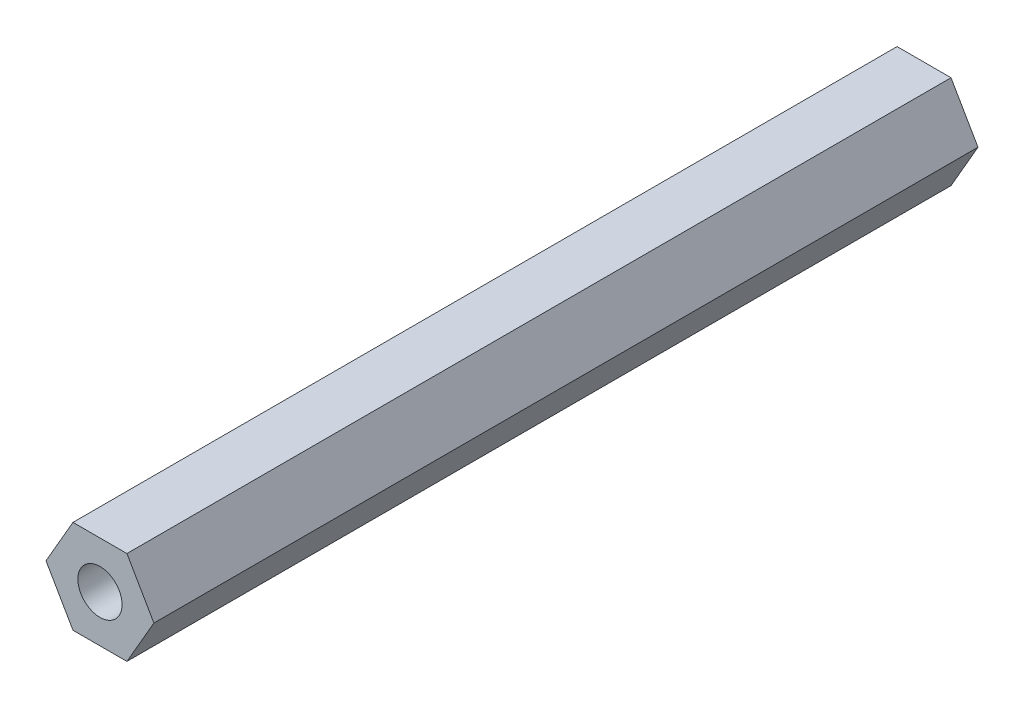
ISO-10303-21;
HEADER;
FILE_DESCRIPTION(('STEP AP214'),'2;1');
FILE_NAME('part.step','',(''),(''),'','','');
FILE_SCHEMA(('AUTOMOTIVE_DESIGN { 1 0 10303 214 1 1 1 1 }'));
ENDSEC;
DATA;
#1=APPLICATION_CONTEXT('core data for automotive mechanical design processes');
#2=APPLICATION_PROTOCOL_DEFINITION('international standard','automotive_design',2000,#1);
#3=PRODUCT_CONTEXT('',#1,'mechanical');
#4=PRODUCT('Part','Part','',(#3));
#5=PRODUCT_RELATED_PRODUCT_CATEGORY('part','',(#4));
#6=PRODUCT_DEFINITION_FORMATION('','',#4);
#7=PRODUCT_DEFINITION_CONTEXT('part definition',#1,'design');
#8=PRODUCT_DEFINITION('design','',#6,#7);
#9=PRODUCT_DEFINITION_SHAPE('','',#8);
#10=(LENGTH_UNIT() NAMED_UNIT(*) SI_UNIT(.MILLI.,.METRE.));
#11=(NAMED_UNIT(*) PLANE_ANGLE_UNIT() SI_UNIT($,.RADIAN.));
#12=(NAMED_UNIT(*) SI_UNIT($,.STERADIAN.) SOLID_ANGLE_UNIT());
#13=UNCERTAINTY_MEASURE_WITH_UNIT(LENGTH_MEASURE(1.E-05),#10,'distance_accuracy_value','');
#14=(GEOMETRIC_REPRESENTATION_CONTEXT(3) GLOBAL_UNCERTAINTY_ASSIGNED_CONTEXT((#13)) GLOBAL_UNIT_ASSIGNED_CONTEXT((#10,
#11,#12)) REPRESENTATION_CONTEXT('',''));
#15=CARTESIAN_POINT('',(0.,0.,0.));
#16=DIRECTION('',(0.,0.,1.));
#17=DIRECTION('',(1.,0.,0.));
#18=AXIS2_PLACEMENT_3D('',#15,#16,#17);
#19=CARTESIAN_POINT('',(0.,0.,56.));
#20=DIRECTION('',(0.,0.,1.));
#21=DIRECTION('',(1.,0.,0.));
#22=AXIS2_PLACEMENT_3D('',#19,#20,#21);
#23=PLANE('',#22);
#24=DIRECTION('',(0.499999999999995,0.866025403784442,0.));
#25=VECTOR('',#24,1.);
#26=CARTESIAN_POINT('',(1.83308710467709,-3.17499999999997,56.));
#27=LINE('',#26,#25);
#28=CARTESIAN_POINT('',(1.83308710467709,-3.17499999999997,56.));
#29=VERTEX_POINT('',#28);
#30=CARTESIAN_POINT('',(3.66617420935411,0.,56.));
#31=VERTEX_POINT('',#30);
#32=EDGE_CURVE('E146',#29,#31,#27,.T.);
#33=ORIENTED_EDGE('',*,*,#32,.T.);
#34=DIRECTION('',(-0.500000000000001,0.866025403784438,0.));
#35=VECTOR('',#34,1.);
#36=CARTESIAN_POINT('',(3.66617420935411,0.,56.));
#37=LINE('',#36,#35);
#38=CARTESIAN_POINT('',(1.83308710467705,3.17499999999999,56.));
#39=VERTEX_POINT('',#38);
#40=EDGE_CURVE('E94',#31,#39,#37,.T.);
#41=ORIENTED_EDGE('',*,*,#40,.T.);
#42=DIRECTION('',(-1.,0.,0.));
#43=VECTOR('',#42,1.);
#44=CARTESIAN_POINT('',(1.83308710467705,3.17499999999999,56.));
#45=LINE('',#44,#43);
#46=CARTESIAN_POINT('',(-1.83308710467707,3.17499999999998,56.));
#47=VERTEX_POINT('',#46);
#48=EDGE_CURVE('E107',#39,#47,#45,.T.);
#49=ORIENTED_EDGE('',*,*,#48,.T.);
#50=DIRECTION('',(-0.499999999999995,-0.866025403784442,0.));
#51=VECTOR('',#50,1.);
#52=CARTESIAN_POINT('',(-1.83308710467707,3.17499999999998,56.));
#53=LINE('',#52,#51);
#54=CARTESIAN_POINT('',(-3.66617420935411,0.,56.));
#55=VERTEX_POINT('',#54);
#56=EDGE_CURVE('E101',#47,#55,#53,.T.);
#57=ORIENTED_EDGE('',*,*,#56,.T.);
#58=DIRECTION('',(0.500000000000007,-0.866025403784434,0.));
#59=VECTOR('',#58,1.);
#60=CARTESIAN_POINT('',(-3.66617420935411,0.,56.));
#61=LINE('',#60,#59);
#62=CARTESIAN_POINT('',(-1.83308710467703,-3.17500000000001,56.));
#63=VERTEX_POINT('',#62);
#64=EDGE_CURVE('E105',#55,#63,#61,.T.);
#65=ORIENTED_EDGE('',*,*,#64,.T.);
#66=DIRECTION('',(1.,0.,0.));
#67=VECTOR('',#66,1.);
#68=CARTESIAN_POINT('',(-1.83308710467703,-3.17500000000001,56.));
#69=LINE('',#68,#67);
#70=EDGE_CURVE('E57',#63,#29,#69,.T.);
#71=ORIENTED_EDGE('',*,*,#70,.T.);
#72=EDGE_LOOP('',(#33,#41,#49,#57,#65,#71));
#73=FACE_BOUND('',#72,.T.);
#74=CARTESIAN_POINT('',(0.,0.,56.));
#75=DIRECTION('',(0.,0.,1.));
#76=DIRECTION('',(1.,0.,0.));
#77=AXIS2_PLACEMENT_3D('',#74,#75,#76);
#78=CIRCLE('',#77,1.5);
#79=CARTESIAN_POINT('',(1.5,0.,56.));
#80=VERTEX_POINT('',#79);
#81=EDGE_CURVE('E134',#80,#80,#78,.T.);
#82=ORIENTED_EDGE('',*,*,#81,.F.);
#83=EDGE_LOOP('',(#82));
#84=FACE_BOUND('',#83,.T.);
#85=ADVANCED_FACE('F39',(#73,#84),#23,.T.);
#86=CARTESIAN_POINT('',(0.,0.,0.));
#87=DIRECTION('',(0.,0.,1.));
#88=DIRECTION('',(1.,0.,0.));
#89=AXIS2_PLACEMENT_3D('',#86,#87,#88);
#90=PLANE('',#89);
#91=DIRECTION('',(0.499999999999995,0.866025403784442,0.));
#92=VECTOR('',#91,1.);
#93=CARTESIAN_POINT('',(1.83308710467709,-3.17499999999997,0.));
#94=LINE('',#93,#92);
#95=CARTESIAN_POINT('',(1.83308710467709,-3.17499999999997,0.));
#96=VERTEX_POINT('',#95);
#97=CARTESIAN_POINT('',(3.66617420935411,0.,0.));
#98=VERTEX_POINT('',#97);
#99=EDGE_CURVE('E129',#96,#98,#94,.T.);
#100=ORIENTED_EDGE('',*,*,#99,.F.);
#101=DIRECTION('',(1.,0.,0.));
#102=VECTOR('',#101,1.);
#103=CARTESIAN_POINT('',(-1.83308710467703,-3.17500000000001,0.));
#104=LINE('',#103,#102);
#105=CARTESIAN_POINT('',(-1.83308710467703,-3.17500000000001,0.));
#106=VERTEX_POINT('',#105);
#107=EDGE_CURVE('E86',#106,#96,#104,.T.);
#108=ORIENTED_EDGE('',*,*,#107,.F.);
#109=DIRECTION('',(0.500000000000007,-0.866025403784434,0.));
#110=VECTOR('',#109,1.);
#111=CARTESIAN_POINT('',(-3.66617420935411,0.,0.));
#112=LINE('',#111,#110);
#113=CARTESIAN_POINT('',(-3.66617420935411,0.,0.));
#114=VERTEX_POINT('',#113);
#115=EDGE_CURVE('E80',#114,#106,#112,.T.);
#116=ORIENTED_EDGE('',*,*,#115,.F.);
#117=DIRECTION('',(-0.499999999999995,-0.866025403784442,0.));
#118=VECTOR('',#117,1.);
#119=CARTESIAN_POINT('',(-1.83308710467707,3.17499999999998,0.));
#120=LINE('',#119,#118);
#121=CARTESIAN_POINT('',(-1.83308710467707,3.17499999999998,0.));
#122=VERTEX_POINT('',#121);
#123=EDGE_CURVE('E116',#122,#114,#120,.T.);
#124=ORIENTED_EDGE('',*,*,#123,.F.);
#125=DIRECTION('',(-1.,0.,0.));
#126=VECTOR('',#125,1.);
#127=CARTESIAN_POINT('',(1.83308710467705,3.17499999999999,0.));
#128=LINE('',#127,#126);
#129=CARTESIAN_POINT('',(1.83308710467705,3.17499999999999,0.));
#130=VERTEX_POINT('',#129);
#131=EDGE_CURVE('E137',#130,#122,#128,.T.);
#132=ORIENTED_EDGE('',*,*,#131,.F.);
#133=DIRECTION('',(-0.500000000000001,0.866025403784438,0.));
#134=VECTOR('',#133,1.);
#135=CARTESIAN_POINT('',(3.66617420935411,0.,0.));
#136=LINE('',#135,#134);
#137=EDGE_CURVE('E133',#98,#130,#136,.T.);
#138=ORIENTED_EDGE('',*,*,#137,.F.);
#139=EDGE_LOOP('',(#100,#108,#116,#124,#132,#138));
#140=FACE_BOUND('',#139,.T.);
#141=CARTESIAN_POINT('',(0.,0.,0.));
#142=DIRECTION('',(0.,0.,1.));
#143=DIRECTION('',(1.,0.,0.));
#144=AXIS2_PLACEMENT_3D('',#141,#142,#143);
#145=CIRCLE('',#144,1.5);
#146=CARTESIAN_POINT('',(1.5,0.,0.));
#147=VERTEX_POINT('',#146);
#148=EDGE_CURVE('E243',#147,#147,#145,.T.);
#149=ORIENTED_EDGE('',*,*,#148,.T.);
#150=EDGE_LOOP('',(#149));
#151=FACE_BOUND('',#150,.T.);
#152=ADVANCED_FACE('F159',(#140,#151),#90,.F.);
#153=CARTESIAN_POINT('',(1.83308710467709,-3.17499999999997,56.));
#154=DIRECTION('',(-0.866025403784442,0.499999999999995,0.));
#155=DIRECTION('',(-0.499999999999995,-0.866025403784442,0.));
#156=AXIS2_PLACEMENT_3D('',#153,#154,#155);
#157=PLANE('',#156);
#158=ORIENTED_EDGE('',*,*,#99,.T.);
#159=DIRECTION('',(0.,0.,-1.));
#160=VECTOR('',#159,1.);
#161=CARTESIAN_POINT('',(3.66617420935411,0.,56.));
#162=LINE('',#161,#160);
#163=EDGE_CURVE('E11',#31,#98,#162,.T.);
#164=ORIENTED_EDGE('',*,*,#163,.F.);
#165=ORIENTED_EDGE('',*,*,#32,.F.);
#166=DIRECTION('',(0.,0.,-1.));
#167=VECTOR('',#166,1.);
#168=CARTESIAN_POINT('',(1.83308710467709,-3.17499999999997,56.));
#169=LINE('',#168,#167);
#170=EDGE_CURVE('E125',#29,#96,#169,.T.);
#171=ORIENTED_EDGE('',*,*,#170,.T.);
#172=EDGE_LOOP('',(#158,#164,#165,#171));
#173=FACE_BOUND('',#172,.T.);
#174=ADVANCED_FACE('F41',(#173),#157,.F.);
#175=CARTESIAN_POINT('',(3.66617420935411,0.,56.));
#176=DIRECTION('',(-0.866025403784438,-0.500000000000001,0.));
#177=DIRECTION('',(0.500000000000001,-0.866025403784438,0.));
#178=AXIS2_PLACEMENT_3D('',#175,#176,#177);
#179=PLANE('',#178);
#180=ORIENTED_EDGE('',*,*,#137,.T.);
#181=DIRECTION('',(0.,0.,-1.));
#182=VECTOR('',#181,1.);
#183=CARTESIAN_POINT('',(1.83308710467705,3.17499999999999,56.));
#184=LINE('',#183,#182);
#185=EDGE_CURVE('E49',#39,#130,#184,.T.);
#186=ORIENTED_EDGE('',*,*,#185,.F.);
#187=ORIENTED_EDGE('',*,*,#40,.F.);
#188=ORIENTED_EDGE('',*,*,#163,.T.);
#189=EDGE_LOOP('',(#180,#186,#187,#188));
#190=FACE_BOUND('',#189,.T.);
#191=ADVANCED_FACE('F184',(#190),#179,.F.);
#192=CARTESIAN_POINT('',(1.83308710467705,3.17499999999999,56.));
#193=DIRECTION('',(0.,-1.,0.));
#194=DIRECTION('',(1.,0.,0.));
#195=AXIS2_PLACEMENT_3D('',#192,#193,#194);
#196=PLANE('',#195);
#197=ORIENTED_EDGE('',*,*,#131,.T.);
#198=DIRECTION('',(0.,0.,-1.));
#199=VECTOR('',#198,1.);
#200=CARTESIAN_POINT('',(-1.83308710467707,3.17499999999998,56.));
#201=LINE('',#200,#199);
#202=EDGE_CURVE('E118',#47,#122,#201,.T.);
#203=ORIENTED_EDGE('',*,*,#202,.F.);
#204=ORIENTED_EDGE('',*,*,#48,.F.);
#205=ORIENTED_EDGE('',*,*,#185,.T.);
#206=EDGE_LOOP('',(#197,#203,#204,#205));
#207=FACE_BOUND('',#206,.T.);
#208=ADVANCED_FACE('F156',(#207),#196,.F.);
#209=CARTESIAN_POINT('',(-1.83308710467707,3.17499999999998,56.));
#210=DIRECTION('',(0.866025403784442,-0.499999999999995,0.));
#211=DIRECTION('',(0.499999999999995,0.866025403784442,0.));
#212=AXIS2_PLACEMENT_3D('',#209,#210,#211);
#213=PLANE('',#212);
#214=ORIENTED_EDGE('',*,*,#123,.T.);
#215=DIRECTION('',(0.,0.,-1.));
#216=VECTOR('',#215,1.);
#217=CARTESIAN_POINT('',(-3.66617420935411,0.,56.));
#218=LINE('',#217,#216);
#219=EDGE_CURVE('E113',#55,#114,#218,.T.);
#220=ORIENTED_EDGE('',*,*,#219,.F.);
#221=ORIENTED_EDGE('',*,*,#56,.F.);
#222=ORIENTED_EDGE('',*,*,#202,.T.);
#223=EDGE_LOOP('',(#214,#220,#221,#222));
#224=FACE_BOUND('',#223,.T.);
#225=ADVANCED_FACE('F114',(#224),#213,.F.);
#226=CARTESIAN_POINT('',(-3.66617420935411,0.,56.));
#227=DIRECTION('',(0.866025403784434,0.500000000000007,0.));
#228=DIRECTION('',(-0.500000000000007,0.866025403784435,0.));
#229=AXIS2_PLACEMENT_3D('',#226,#227,#228);
#230=PLANE('',#229);
#231=ORIENTED_EDGE('',*,*,#115,.T.);
#232=DIRECTION('',(0.,0.,-1.));
#233=VECTOR('',#232,1.);
#234=CARTESIAN_POINT('',(-1.83308710467703,-3.17500000000001,56.));
#235=LINE('',#234,#233);
#236=EDGE_CURVE('E119',#63,#106,#235,.T.);
#237=ORIENTED_EDGE('',*,*,#236,.F.);
#238=ORIENTED_EDGE('',*,*,#64,.F.);
#239=ORIENTED_EDGE('',*,*,#219,.T.);
#240=EDGE_LOOP('',(#231,#237,#238,#239));
#241=FACE_BOUND('',#240,.T.);
#242=ADVANCED_FACE('F121',(#241),#230,.F.);
#243=CARTESIAN_POINT('',(-1.83308710467703,-3.17500000000001,56.));
#244=DIRECTION('',(0.,1.,0.));
#245=DIRECTION('',(-1.,0.,0.));
#246=AXIS2_PLACEMENT_3D('',#243,#244,#245);
#247=PLANE('',#246);
#248=ORIENTED_EDGE('',*,*,#107,.T.);
#249=ORIENTED_EDGE('',*,*,#170,.F.);
#250=ORIENTED_EDGE('',*,*,#70,.F.);
#251=ORIENTED_EDGE('',*,*,#236,.T.);
#252=EDGE_LOOP('',(#248,#249,#250,#251));
#253=FACE_BOUND('',#252,.T.);
#254=ADVANCED_FACE('F164',(#253),#247,.F.);
#255=CARTESIAN_POINT('',(0.,0.,56.));
#256=DIRECTION('',(0.,0.,-1.));
#257=DIRECTION('',(-1.,0.,0.));
#258=AXIS2_PLACEMENT_3D('',#255,#256,#257);
#259=CYLINDRICAL_SURFACE('',#258,1.5);
#260=ORIENTED_EDGE('',*,*,#81,.T.);
#261=EDGE_LOOP('',(#260));
#262=FACE_BOUND('',#261,.T.);
#263=ORIENTED_EDGE('',*,*,#148,.F.);
#264=EDGE_LOOP('',(#263));
#265=FACE_BOUND('',#264,.T.);
#266=ADVANCED_FACE('F166',(#262,#265),#259,.F.);
#267=CLOSED_SHELL('',(#85,#152,#174,#191,#208,#225,#242,#254,#266));
#268=MANIFOLD_SOLID_BREP('B2',#267);
#269=ADVANCED_BREP_SHAPE_REPRESENTATION('',(#18,#268),#14);
#270=SHAPE_DEFINITION_REPRESENTATION(#9,#269);
ENDSEC;
END-ISO-10303-21;
